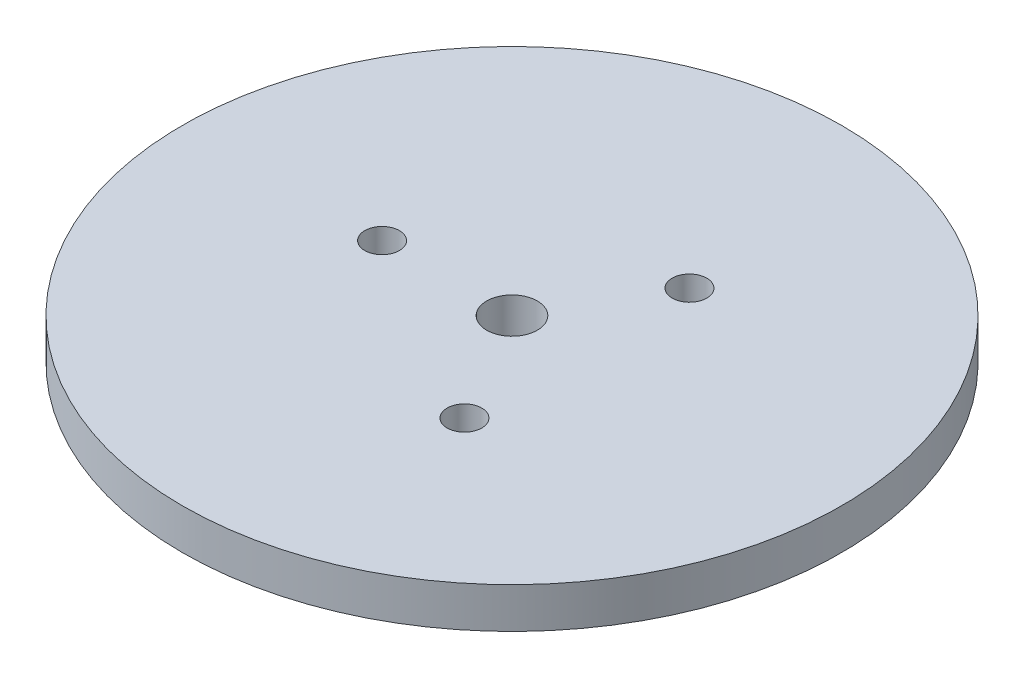
ISO-10303-21;
HEADER;
FILE_DESCRIPTION(('STEP AP214'),'2;1');
FILE_NAME('part.step','',(''),(''),'','','');
FILE_SCHEMA(('AUTOMOTIVE_DESIGN { 1 0 10303 214 1 1 1 1 }'));
ENDSEC;
DATA;
#1=APPLICATION_CONTEXT('core data for automotive mechanical design processes');
#2=APPLICATION_PROTOCOL_DEFINITION('international standard','automotive_design',2000,#1);
#3=PRODUCT_CONTEXT('',#1,'mechanical');
#4=PRODUCT('Part','Part','',(#3));
#5=PRODUCT_RELATED_PRODUCT_CATEGORY('part','',(#4));
#6=PRODUCT_DEFINITION_FORMATION('','',#4);
#7=PRODUCT_DEFINITION_CONTEXT('part definition',#1,'design');
#8=PRODUCT_DEFINITION('design','',#6,#7);
#9=PRODUCT_DEFINITION_SHAPE('','',#8);
#10=(LENGTH_UNIT() NAMED_UNIT(*) SI_UNIT(.MILLI.,.METRE.));
#11=(NAMED_UNIT(*) PLANE_ANGLE_UNIT() SI_UNIT($,.RADIAN.));
#12=(NAMED_UNIT(*) SI_UNIT($,.STERADIAN.) SOLID_ANGLE_UNIT());
#13=UNCERTAINTY_MEASURE_WITH_UNIT(LENGTH_MEASURE(1.E-05),#10,'distance_accuracy_value','');
#14=(GEOMETRIC_REPRESENTATION_CONTEXT(3) GLOBAL_UNCERTAINTY_ASSIGNED_CONTEXT((#13)) GLOBAL_UNIT_ASSIGNED_CONTEXT((#10,
#11,#12)) REPRESENTATION_CONTEXT('',''));
#15=CARTESIAN_POINT('',(0.,0.,0.));
#16=DIRECTION('',(0.,0.,1.));
#17=DIRECTION('',(1.,0.,0.));
#18=AXIS2_PLACEMENT_3D('',#15,#16,#17);
#19=CARTESIAN_POINT('',(0.,8.,0.));
#20=DIRECTION('',(0.,-1.,0.));
#21=DIRECTION('',(0.,0.,-1.));
#22=AXIS2_PLACEMENT_3D('',#19,#20,#21);
#23=CYLINDRICAL_SURFACE('',#22,65.);
#24=CARTESIAN_POINT('',(0.,8.,0.));
#25=DIRECTION('',(0.,1.,0.));
#26=DIRECTION('',(0.,0.,1.));
#27=AXIS2_PLACEMENT_3D('',#24,#25,#26);
#28=CIRCLE('',#27,65.);
#29=CARTESIAN_POINT('',(0.,8.,65.));
#30=VERTEX_POINT('',#29);
#31=EDGE_CURVE('E10',#30,#30,#28,.T.);
#32=ORIENTED_EDGE('',*,*,#31,.F.);
#33=EDGE_LOOP('',(#32));
#34=FACE_BOUND('',#33,.T.);
#35=CARTESIAN_POINT('',(0.,0.,0.));
#36=DIRECTION('',(0.,1.,0.));
#37=DIRECTION('',(0.,0.,1.));
#38=AXIS2_PLACEMENT_3D('',#35,#36,#37);
#39=CIRCLE('',#38,65.);
#40=CARTESIAN_POINT('',(0.,0.,65.));
#41=VERTEX_POINT('',#40);
#42=EDGE_CURVE('E37',#41,#41,#39,.T.);
#43=ORIENTED_EDGE('',*,*,#42,.T.);
#44=EDGE_LOOP('',(#43));
#45=FACE_BOUND('',#44,.T.);
#46=ADVANCED_FACE('F40',(#34,#45),#23,.T.);
#47=CARTESIAN_POINT('',(0.,8.,0.));
#48=DIRECTION('',(0.,1.,0.));
#49=DIRECTION('',(0.,0.,1.));
#50=AXIS2_PLACEMENT_3D('',#47,#48,#49);
#51=PLANE('',#50);
#52=CARTESIAN_POINT('',(12.8108970579586,8.,22.1891245949187));
#53=DIRECTION('',(0.,1.,0.));
#54=DIRECTION('',(0.866025403784436,0.,-0.500000000000004));
#55=AXIS2_PLACEMENT_3D('',#52,#53,#54);
#56=CIRCLE('',#55,3.41652107640607);
#57=CARTESIAN_POINT('',(15.7696911026912,8.,20.4808640567157));
#58=VERTEX_POINT('',#57);
#59=EDGE_CURVE('E70',#58,#58,#56,.T.);
#60=ORIENTED_EDGE('',*,*,#59,.F.);
#61=EDGE_LOOP('',(#60));
#62=FACE_BOUND('',#61,.T.);
#63=CARTESIAN_POINT('',(12.8108970579583,8.,-22.1891245949189));
#64=DIRECTION('',(0.,1.,0.));
#65=DIRECTION('',(-0.866025403784443,0.,-0.499999999999992));
#66=AXIS2_PLACEMENT_3D('',#63,#64,#65);
#67=CIRCLE('',#66,3.41652107640607);
#68=CARTESIAN_POINT('',(9.85210301322567,8.,-23.8973851331219));
#69=VERTEX_POINT('',#68);
#70=EDGE_CURVE('E61',#69,#69,#67,.T.);
#71=ORIENTED_EDGE('',*,*,#70,.F.);
#72=EDGE_LOOP('',(#71));
#73=FACE_BOUND('',#72,.T.);
#74=CARTESIAN_POINT('',(-25.621794115917,8.,0.));
#75=DIRECTION('',(0.,1.,0.));
#76=DIRECTION('',(0.,0.,1.));
#77=AXIS2_PLACEMENT_3D('',#74,#75,#76);
#78=CIRCLE('',#77,3.41652107640607);
#79=CARTESIAN_POINT('',(-25.621794115917,8.,3.41652107640607));
#80=VERTEX_POINT('',#79);
#81=EDGE_CURVE('E54',#80,#80,#78,.T.);
#82=ORIENTED_EDGE('',*,*,#81,.F.);
#83=EDGE_LOOP('',(#82));
#84=FACE_BOUND('',#83,.T.);
#85=CARTESIAN_POINT('',(0.,8.,0.));
#86=DIRECTION('',(0.,1.,0.));
#87=DIRECTION('',(0.,0.,1.));
#88=AXIS2_PLACEMENT_3D('',#85,#86,#87);
#89=CIRCLE('',#88,5.);
#90=CARTESIAN_POINT('',(0.,8.,5.));
#91=VERTEX_POINT('',#90);
#92=EDGE_CURVE('E50',#91,#91,#89,.T.);
#93=ORIENTED_EDGE('',*,*,#92,.F.);
#94=EDGE_LOOP('',(#93));
#95=FACE_BOUND('',#94,.T.);
#96=ORIENTED_EDGE('',*,*,#31,.T.);
#97=EDGE_LOOP('',(#96));
#98=FACE_BOUND('',#97,.T.);
#99=ADVANCED_FACE('F85',(#62,#73,#84,#95,#98),#51,.T.);
#100=CARTESIAN_POINT('',(0.,0.,0.));
#101=DIRECTION('',(0.,1.,0.));
#102=DIRECTION('',(0.,0.,1.));
#103=AXIS2_PLACEMENT_3D('',#100,#101,#102);
#104=PLANE('',#103);
#105=CARTESIAN_POINT('',(0.,0.,0.));
#106=DIRECTION('',(0.,1.,0.));
#107=DIRECTION('',(0.,0.,1.));
#108=AXIS2_PLACEMENT_3D('',#105,#106,#107);
#109=CIRCLE('',#108,5.);
#110=CARTESIAN_POINT('',(0.,0.,5.));
#111=VERTEX_POINT('',#110);
#112=EDGE_CURVE('E47',#111,#111,#109,.T.);
#113=ORIENTED_EDGE('',*,*,#112,.T.);
#114=EDGE_LOOP('',(#113));
#115=FACE_BOUND('',#114,.T.);
#116=ORIENTED_EDGE('',*,*,#42,.F.);
#117=EDGE_LOOP('',(#116));
#118=FACE_BOUND('',#117,.T.);
#119=ADVANCED_FACE('F84',(#115,#118),#104,.F.);
#120=CARTESIAN_POINT('',(0.,8.,0.));
#121=DIRECTION('',(0.,-1.,0.));
#122=DIRECTION('',(0.,0.,-1.));
#123=AXIS2_PLACEMENT_3D('',#120,#121,#122);
#124=CYLINDRICAL_SURFACE('',#123,5.);
#125=ORIENTED_EDGE('',*,*,#92,.T.);
#126=EDGE_LOOP('',(#125));
#127=FACE_BOUND('',#126,.T.);
#128=ORIENTED_EDGE('',*,*,#112,.F.);
#129=EDGE_LOOP('',(#128));
#130=FACE_BOUND('',#129,.T.);
#131=ADVANCED_FACE('F91',(#127,#130),#124,.F.);
#132=CARTESIAN_POINT('',(-25.621794115917,1.14090162420571,0.));
#133=DIRECTION('',(0.,1.,0.));
#134=DIRECTION('',(0.,0.,1.));
#135=AXIS2_PLACEMENT_3D('',#132,#133,#134);
#136=CYLINDRICAL_SURFACE('',#135,3.41652107640607);
#137=CARTESIAN_POINT('',(-25.621794115917,1.14090162420571,0.));
#138=DIRECTION('',(0.,1.,0.));
#139=DIRECTION('',(0.,0.,1.));
#140=AXIS2_PLACEMENT_3D('',#137,#138,#139);
#141=CIRCLE('',#140,3.41652107640607);
#142=CARTESIAN_POINT('',(-25.621794115917,1.14090162420571,3.41652107640607));
#143=VERTEX_POINT('',#142);
#144=EDGE_CURVE('E55',#143,#143,#141,.T.);
#145=ORIENTED_EDGE('',*,*,#144,.F.);
#146=EDGE_LOOP('',(#145));
#147=FACE_BOUND('',#146,.T.);
#148=ORIENTED_EDGE('',*,*,#81,.T.);
#149=EDGE_LOOP('',(#148));
#150=FACE_BOUND('',#149,.T.);
#151=ADVANCED_FACE('F96',(#147,#150),#136,.F.);
#152=CARTESIAN_POINT('',(-25.621794115917,1.14090162420571,0.));
#153=DIRECTION('',(0.,1.,0.));
#154=DIRECTION('',(0.,0.,1.));
#155=AXIS2_PLACEMENT_3D('',#152,#153,#154);
#156=PLANE('',#155);
#157=ORIENTED_EDGE('',*,*,#144,.T.);
#158=EDGE_LOOP('',(#157));
#159=FACE_BOUND('',#158,.T.);
#160=ADVANCED_FACE('F127',(#159),#156,.T.);
#161=CARTESIAN_POINT('',(12.8108970579583,1.14090162420571,-22.1891245949189));
#162=DIRECTION('',(0.,1.,0.));
#163=DIRECTION('',(0.,0.,1.));
#164=AXIS2_PLACEMENT_3D('',#161,#162,#163);
#165=CYLINDRICAL_SURFACE('',#164,3.41652107640607);
#166=CARTESIAN_POINT('',(12.8108970579583,1.14090162420571,-22.1891245949189));
#167=DIRECTION('',(0.,1.,0.));
#168=DIRECTION('',(-0.866025403784443,0.,-0.499999999999992));
#169=AXIS2_PLACEMENT_3D('',#166,#167,#168);
#170=CIRCLE('',#169,3.41652107640607);
#171=CARTESIAN_POINT('',(9.85210301322567,1.14090162420571,-23.8973851331219));
#172=VERTEX_POINT('',#171);
#173=EDGE_CURVE('E63',#172,#172,#170,.T.);
#174=ORIENTED_EDGE('',*,*,#173,.F.);
#175=EDGE_LOOP('',(#174));
#176=FACE_BOUND('',#175,.T.);
#177=ORIENTED_EDGE('',*,*,#70,.T.);
#178=EDGE_LOOP('',(#177));
#179=FACE_BOUND('',#178,.T.);
#180=ADVANCED_FACE('F133',(#176,#179),#165,.F.);
#181=CARTESIAN_POINT('',(12.8108970579583,1.14090162420571,-22.1891245949189));
#182=DIRECTION('',(0.,1.,0.));
#183=DIRECTION('',(-0.866025403784443,0.,-0.499999999999992));
#184=AXIS2_PLACEMENT_3D('',#181,#182,#183);
#185=PLANE('',#184);
#186=ORIENTED_EDGE('',*,*,#173,.T.);
#187=EDGE_LOOP('',(#186));
#188=FACE_BOUND('',#187,.T.);
#189=ADVANCED_FACE('F77',(#188),#185,.T.);
#190=CARTESIAN_POINT('',(12.8108970579586,1.14090162420571,22.1891245949187));
#191=DIRECTION('',(0.,1.,0.));
#192=DIRECTION('',(0.,0.,1.));
#193=AXIS2_PLACEMENT_3D('',#190,#191,#192);
#194=CYLINDRICAL_SURFACE('',#193,3.41652107640607);
#195=CARTESIAN_POINT('',(12.8108970579586,1.14090162420571,22.1891245949187));
#196=DIRECTION('',(0.,1.,0.));
#197=DIRECTION('',(0.866025403784436,0.,-0.500000000000004));
#198=AXIS2_PLACEMENT_3D('',#195,#196,#197);
#199=CIRCLE('',#198,3.41652107640607);
#200=CARTESIAN_POINT('',(15.7696911026912,1.14090162420571,20.4808640567157));
#201=VERTEX_POINT('',#200);
#202=EDGE_CURVE('E59',#201,#201,#199,.T.);
#203=ORIENTED_EDGE('',*,*,#202,.F.);
#204=EDGE_LOOP('',(#203));
#205=FACE_BOUND('',#204,.T.);
#206=ORIENTED_EDGE('',*,*,#59,.T.);
#207=EDGE_LOOP('',(#206));
#208=FACE_BOUND('',#207,.T.);
#209=ADVANCED_FACE('F73',(#205,#208),#194,.F.);
#210=CARTESIAN_POINT('',(12.8108970579586,1.14090162420571,22.1891245949187));
#211=DIRECTION('',(0.,1.,0.));
#212=DIRECTION('',(0.866025403784436,0.,-0.500000000000004));
#213=AXIS2_PLACEMENT_3D('',#210,#211,#212);
#214=PLANE('',#213);
#215=ORIENTED_EDGE('',*,*,#202,.T.);
#216=EDGE_LOOP('',(#215));
#217=FACE_BOUND('',#216,.T.);
#218=ADVANCED_FACE('F71',(#217),#214,.T.);
#219=CLOSED_SHELL('',(#46,#99,#119,#131,#151,#160,#180,#189,#209,#218));
#220=MANIFOLD_SOLID_BREP('B2',#219);
#221=ADVANCED_BREP_SHAPE_REPRESENTATION('',(#18,#220),#14);
#222=SHAPE_DEFINITION_REPRESENTATION(#9,#221);
ENDSEC;
END-ISO-10303-21;
